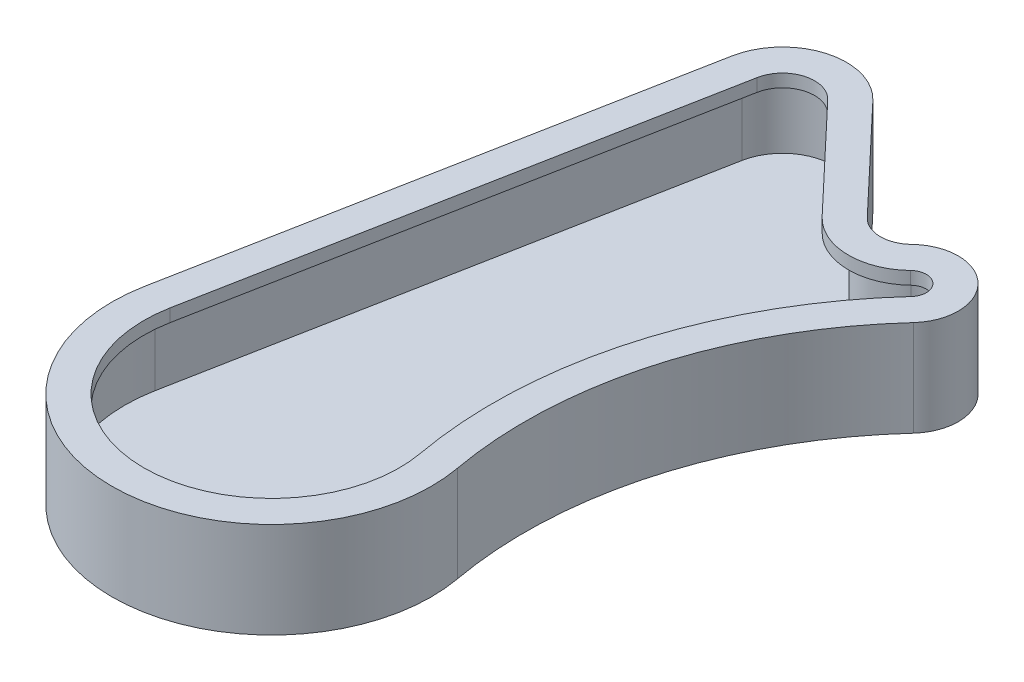
ISO-10303-21;
HEADER;
FILE_DESCRIPTION(('STEP AP214'),'2;1');
FILE_NAME('part.step','',(''),(''),'','','');
FILE_SCHEMA(('AUTOMOTIVE_DESIGN { 1 0 10303 214 1 1 1 1 }'));
ENDSEC;
DATA;
#1=APPLICATION_CONTEXT('core data for automotive mechanical design processes');
#2=APPLICATION_PROTOCOL_DEFINITION('international standard','automotive_design',2000,#1);
#3=PRODUCT_CONTEXT('',#1,'mechanical');
#4=PRODUCT('Part','Part','',(#3));
#5=PRODUCT_RELATED_PRODUCT_CATEGORY('part','',(#4));
#6=PRODUCT_DEFINITION_FORMATION('','',#4);
#7=PRODUCT_DEFINITION_CONTEXT('part definition',#1,'design');
#8=PRODUCT_DEFINITION('design','',#6,#7);
#9=PRODUCT_DEFINITION_SHAPE('','',#8);
#10=(LENGTH_UNIT() NAMED_UNIT(*) SI_UNIT(.MILLI.,.METRE.));
#11=(NAMED_UNIT(*) PLANE_ANGLE_UNIT() SI_UNIT($,.RADIAN.));
#12=(NAMED_UNIT(*) SI_UNIT($,.STERADIAN.) SOLID_ANGLE_UNIT());
#13=UNCERTAINTY_MEASURE_WITH_UNIT(LENGTH_MEASURE(1.E-05),#10,'distance_accuracy_value','');
#14=(GEOMETRIC_REPRESENTATION_CONTEXT(3) GLOBAL_UNCERTAINTY_ASSIGNED_CONTEXT((#13)) GLOBAL_UNIT_ASSIGNED_CONTEXT((#10,
#11,#12)) REPRESENTATION_CONTEXT('',''));
#15=CARTESIAN_POINT('',(0.,0.,0.));
#16=DIRECTION('',(0.,0.,1.));
#17=DIRECTION('',(1.,0.,0.));
#18=AXIS2_PLACEMENT_3D('',#15,#16,#17);
#19=CARTESIAN_POINT('',(0.,15.,0.));
#20=DIRECTION('',(0.,1.,0.));
#21=DIRECTION('',(0.,0.,1.));
#22=AXIS2_PLACEMENT_3D('',#19,#20,#21);
#23=PLANE('',#22);
#24=CARTESIAN_POINT('',(0.,15.,0.));
#25=DIRECTION('',(0.,1.,0.));
#26=DIRECTION('',(0.,0.,1.));
#27=AXIS2_PLACEMENT_3D('',#24,#25,#26);
#28=CIRCLE('',#27,25.);
#29=CARTESIAN_POINT('',(-24.5566150710964,15.,-4.6875));
#30=VERTEX_POINT('',#29);
#31=CARTESIAN_POINT('',(24.595709121542,15.,-4.47784466104999));
#32=VERTEX_POINT('',#31);
#33=EDGE_CURVE('E298',#30,#32,#28,.T.);
#34=ORIENTED_EDGE('',*,*,#33,.T.);
#35=CARTESIAN_POINT('',(88.5445528375513,15.,-16.1202407797801));
#36=DIRECTION('',(0.,-1.,0.));
#37=DIRECTION('',(0.,0.,-1.));
#38=AXIS2_PLACEMENT_3D('',#35,#36,#37);
#39=CIRCLE('',#38,65.);
#40=CARTESIAN_POINT('',(40.5390916728501,15.,-59.9434731841152));
#41=VERTEX_POINT('',#40);
#42=EDGE_CURVE('E301',#32,#41,#39,.T.);
#43=ORIENTED_EDGE('',*,*,#42,.T.);
#44=CARTESIAN_POINT('',(35.,15.,-65.));
#45=DIRECTION('',(0.,1.,0.));
#46=DIRECTION('',(0.,0.,1.));
#47=AXIS2_PLACEMENT_3D('',#44,#45,#46);
#48=CIRCLE('',#47,7.50000000000001);
#49=CARTESIAN_POINT('',(29.7951945281308,15.,-70.4));
#50=VERTEX_POINT('',#49);
#51=EDGE_CURVE('E304',#41,#50,#48,.T.);
#52=ORIENTED_EDGE('',*,*,#51,.T.);
#53=CARTESIAN_POINT('',(26.3253242135513,15.,-74.));
#54=DIRECTION('',(0.,-1.,0.));
#55=DIRECTION('',(0.,0.,1.));
#56=AXIS2_PLACEMENT_3D('',#53,#54,#55);
#57=CIRCLE('',#56,5.);
#58=CARTESIAN_POINT('',(22.6931837774403,15.,-70.5637875717051));
#59=VERTEX_POINT('',#58);
#60=EDGE_CURVE('E306',#50,#59,#57,.T.);
#61=ORIENTED_EDGE('',*,*,#60,.T.);
#62=DIRECTION('',(-0.687242485658972,0.,-0.726428087222182));
#63=VECTOR('',#62,1.);
#64=CARTESIAN_POINT('',(7.26428087222182,15.,-86.8724248565897));
#65=LINE('',#64,#63);
#66=CARTESIAN_POINT('',(7.26428087222182,15.,-86.8724248565897));
#67=VERTEX_POINT('',#66);
#68=EDGE_CURVE('E308',#59,#67,#65,.T.);
#69=ORIENTED_EDGE('',*,*,#68,.T.);
#70=CARTESIAN_POINT('',(0.,15.,-80.));
#71=DIRECTION('',(0.,1.,0.));
#72=DIRECTION('',(0.,0.,1.));
#73=AXIS2_PLACEMENT_3D('',#70,#71,#72);
#74=CIRCLE('',#73,9.99999999999999);
#75=CARTESIAN_POINT('',(-9.82264602843857,15.,-81.875));
#76=VERTEX_POINT('',#75);
#77=EDGE_CURVE('E310',#67,#76,#74,.T.);
#78=ORIENTED_EDGE('',*,*,#77,.T.);
#79=DIRECTION('',(-0.1875,0.,0.982264602843857));
#80=VECTOR('',#79,1.);
#81=CARTESIAN_POINT('',(-24.5566150710964,15.,-4.6875));
#82=LINE('',#81,#80);
#83=EDGE_CURVE('E312',#76,#30,#82,.T.);
#84=ORIENTED_EDGE('',*,*,#83,.T.);
#85=EDGE_LOOP('',(#34,#43,#52,#61,#69,#78,#84));
#86=FACE_BOUND('',#85,.T.);
#87=CARTESIAN_POINT('',(0.,15.,0.));
#88=DIRECTION('',(0.,1.,0.));
#89=DIRECTION('',(0.,0.,1.));
#90=AXIS2_PLACEMENT_3D('',#87,#88,#89);
#91=CIRCLE('',#90,20.);
#92=CARTESIAN_POINT('',(-19.6452920568771,15.,-3.75));
#93=VERTEX_POINT('',#92);
#94=CARTESIAN_POINT('',(19.6765672972336,15.,-3.58227572884001));
#95=VERTEX_POINT('',#94);
#96=EDGE_CURVE('E186',#93,#95,#91,.T.);
#97=ORIENTED_EDGE('',*,*,#96,.F.);
#98=DIRECTION('',(-0.1875,0.,0.982264602843857));
#99=VECTOR('',#98,1.);
#100=CARTESIAN_POINT('',(-4.91132301421928,15.,-80.9375));
#101=LINE('',#100,#99);
#102=CARTESIAN_POINT('',(-4.91132301421928,15.,-80.9375));
#103=VERTEX_POINT('',#102);
#104=EDGE_CURVE('E204',#103,#93,#101,.T.);
#105=ORIENTED_EDGE('',*,*,#104,.F.);
#106=CARTESIAN_POINT('',(0.,15.,-80.));
#107=DIRECTION('',(0.,1.,0.));
#108=DIRECTION('',(0.,0.,1.));
#109=AXIS2_PLACEMENT_3D('',#106,#107,#108);
#110=CIRCLE('',#109,4.99999999999999);
#111=CARTESIAN_POINT('',(3.63214043611092,15.,-83.4362124282948));
#112=VERTEX_POINT('',#111);
#113=EDGE_CURVE('E207',#112,#103,#110,.T.);
#114=ORIENTED_EDGE('',*,*,#113,.F.);
#115=DIRECTION('',(-0.687242485658972,0.,-0.726428087222182));
#116=VECTOR('',#115,1.);
#117=CARTESIAN_POINT('',(19.0610433413294,15.,-67.1275751434103));
#118=LINE('',#117,#116);
#119=CARTESIAN_POINT('',(19.0610433413294,15.,-67.1275751434103));
#120=VERTEX_POINT('',#119);
#121=EDGE_CURVE('E229',#120,#112,#118,.T.);
#122=ORIENTED_EDGE('',*,*,#121,.F.);
#123=CARTESIAN_POINT('',(26.3253242135513,15.,-74.));
#124=DIRECTION('',(0.,-1.,0.));
#125=DIRECTION('',(0.,0.,1.));
#126=AXIS2_PLACEMENT_3D('',#123,#124,#125);
#127=CIRCLE('',#126,10.);
#128=CARTESIAN_POINT('',(33.2650648427102,15.,-66.8));
#129=VERTEX_POINT('',#128);
#130=EDGE_CURVE('E226',#129,#120,#127,.T.);
#131=ORIENTED_EDGE('',*,*,#130,.F.);
#132=CARTESIAN_POINT('',(35.,15.,-65.));
#133=DIRECTION('',(0.,1.,0.));
#134=DIRECTION('',(0.,0.,1.));
#135=AXIS2_PLACEMENT_3D('',#132,#133,#134);
#136=CIRCLE('',#135,2.5);
#137=CARTESIAN_POINT('',(36.8463638909501,15.,-63.3144910613717));
#138=VERTEX_POINT('',#137);
#139=EDGE_CURVE('E223',#138,#129,#136,.T.);
#140=ORIENTED_EDGE('',*,*,#139,.F.);
#141=CARTESIAN_POINT('',(88.5445528375513,15.,-16.1202407797801));
#142=DIRECTION('',(0.,-1.,0.));
#143=DIRECTION('',(0.,0.,1.));
#144=AXIS2_PLACEMENT_3D('',#141,#142,#143);
#145=CIRCLE('',#144,70.);
#146=EDGE_CURVE('E221',#95,#138,#145,.T.);
#147=ORIENTED_EDGE('',*,*,#146,.F.);
#148=EDGE_LOOP('',(#97,#105,#114,#122,#131,#140,#147));
#149=FACE_BOUND('',#148,.T.);
#150=ADVANCED_FACE('F35',(#86,#149),#23,.T.);
#151=CARTESIAN_POINT('',(0.,15.,0.));
#152=DIRECTION('',(0.,-1.,0.));
#153=DIRECTION('',(0.,0.,-1.));
#154=AXIS2_PLACEMENT_3D('',#151,#152,#153);
#155=CYLINDRICAL_SURFACE('',#154,25.);
#156=DIRECTION('',(0.,-1.,0.));
#157=VECTOR('',#156,1.);
#158=CARTESIAN_POINT('',(-24.5566150710964,15.,-4.6875));
#159=LINE('',#158,#157);
#160=CARTESIAN_POINT('',(-24.5566150710964,0.,-4.6875));
#161=VERTEX_POINT('',#160);
#162=EDGE_CURVE('E314',#30,#161,#159,.T.);
#163=ORIENTED_EDGE('',*,*,#162,.T.);
#164=CARTESIAN_POINT('',(0.,0.,0.));
#165=DIRECTION('',(0.,1.,0.));
#166=DIRECTION('',(0.,0.,1.));
#167=AXIS2_PLACEMENT_3D('',#164,#165,#166);
#168=CIRCLE('',#167,25.);
#169=CARTESIAN_POINT('',(24.595709121542,0.,-4.47784466104999));
#170=VERTEX_POINT('',#169);
#171=EDGE_CURVE('E283',#161,#170,#168,.T.);
#172=ORIENTED_EDGE('',*,*,#171,.T.);
#173=DIRECTION('',(0.,-1.,0.));
#174=VECTOR('',#173,1.);
#175=CARTESIAN_POINT('',(24.595709121542,15.,-4.47784466104999));
#176=LINE('',#175,#174);
#177=EDGE_CURVE('E43',#32,#170,#176,.T.);
#178=ORIENTED_EDGE('',*,*,#177,.F.);
#179=ORIENTED_EDGE('',*,*,#33,.F.);
#180=EDGE_LOOP('',(#163,#172,#178,#179));
#181=FACE_BOUND('',#180,.T.);
#182=ADVANCED_FACE('F37',(#181),#155,.T.);
#183=CARTESIAN_POINT('',(88.5445528375513,15.,-16.1202407797801));
#184=DIRECTION('',(0.,-1.,0.));
#185=DIRECTION('',(0.,0.,-1.));
#186=AXIS2_PLACEMENT_3D('',#183,#184,#185);
#187=CYLINDRICAL_SURFACE('',#186,65.);
#188=ORIENTED_EDGE('',*,*,#177,.T.);
#189=CARTESIAN_POINT('',(88.5445528375513,0.,-16.1202407797801));
#190=DIRECTION('',(0.,-1.,0.));
#191=DIRECTION('',(0.,0.,-1.));
#192=AXIS2_PLACEMENT_3D('',#189,#190,#191);
#193=CIRCLE('',#192,65.);
#194=CARTESIAN_POINT('',(40.5390916728501,0.,-59.9434731841152));
#195=VERTEX_POINT('',#194);
#196=EDGE_CURVE('E317',#170,#195,#193,.T.);
#197=ORIENTED_EDGE('',*,*,#196,.T.);
#198=DIRECTION('',(0.,-1.,0.));
#199=VECTOR('',#198,1.);
#200=CARTESIAN_POINT('',(40.5390916728501,15.,-59.9434731841152));
#201=LINE('',#200,#199);
#202=EDGE_CURVE('E343',#41,#195,#201,.T.);
#203=ORIENTED_EDGE('',*,*,#202,.F.);
#204=ORIENTED_EDGE('',*,*,#42,.F.);
#205=EDGE_LOOP('',(#188,#197,#203,#204));
#206=FACE_BOUND('',#205,.T.);
#207=ADVANCED_FACE('F347',(#206),#187,.F.);
#208=CARTESIAN_POINT('',(35.,15.,-65.));
#209=DIRECTION('',(0.,-1.,0.));
#210=DIRECTION('',(0.,0.,-1.));
#211=AXIS2_PLACEMENT_3D('',#208,#209,#210);
#212=CYLINDRICAL_SURFACE('',#211,7.50000000000001);
#213=ORIENTED_EDGE('',*,*,#202,.T.);
#214=CARTESIAN_POINT('',(35.,0.,-65.));
#215=DIRECTION('',(0.,1.,0.));
#216=DIRECTION('',(0.,0.,1.));
#217=AXIS2_PLACEMENT_3D('',#214,#215,#216);
#218=CIRCLE('',#217,7.50000000000001);
#219=CARTESIAN_POINT('',(29.7951945281308,0.,-70.4));
#220=VERTEX_POINT('',#219);
#221=EDGE_CURVE('E320',#195,#220,#218,.T.);
#222=ORIENTED_EDGE('',*,*,#221,.T.);
#223=DIRECTION('',(0.,-1.,0.));
#224=VECTOR('',#223,1.);
#225=CARTESIAN_POINT('',(29.7951945281308,15.,-70.4));
#226=LINE('',#225,#224);
#227=EDGE_CURVE('E341',#50,#220,#226,.T.);
#228=ORIENTED_EDGE('',*,*,#227,.F.);
#229=ORIENTED_EDGE('',*,*,#51,.F.);
#230=EDGE_LOOP('',(#213,#222,#228,#229));
#231=FACE_BOUND('',#230,.T.);
#232=ADVANCED_FACE('F378',(#231),#212,.T.);
#233=CARTESIAN_POINT('',(26.3253242135513,15.,-74.));
#234=DIRECTION('',(0.,-1.,0.));
#235=DIRECTION('',(0.,0.,-1.));
#236=AXIS2_PLACEMENT_3D('',#233,#234,#235);
#237=CYLINDRICAL_SURFACE('',#236,5.);
#238=ORIENTED_EDGE('',*,*,#227,.T.);
#239=CARTESIAN_POINT('',(26.3253242135513,0.,-74.));
#240=DIRECTION('',(0.,-1.,0.));
#241=DIRECTION('',(0.,0.,1.));
#242=AXIS2_PLACEMENT_3D('',#239,#240,#241);
#243=CIRCLE('',#242,5.);
#244=CARTESIAN_POINT('',(22.6931837774403,0.,-70.5637875717051));
#245=VERTEX_POINT('',#244);
#246=EDGE_CURVE('E323',#220,#245,#243,.T.);
#247=ORIENTED_EDGE('',*,*,#246,.T.);
#248=DIRECTION('',(0.,-1.,0.));
#249=VECTOR('',#248,1.);
#250=CARTESIAN_POINT('',(22.6931837774403,15.,-70.5637875717051));
#251=LINE('',#250,#249);
#252=EDGE_CURVE('E339',#59,#245,#251,.T.);
#253=ORIENTED_EDGE('',*,*,#252,.F.);
#254=ORIENTED_EDGE('',*,*,#60,.F.);
#255=EDGE_LOOP('',(#238,#247,#253,#254));
#256=FACE_BOUND('',#255,.T.);
#257=ADVANCED_FACE('F374',(#256),#237,.F.);
#258=CARTESIAN_POINT('',(7.26428087222182,15.,-86.8724248565897));
#259=DIRECTION('',(-0.726428087222182,0.,0.687242485658972));
#260=DIRECTION('',(0.687242485658972,0.,0.726428087222182));
#261=AXIS2_PLACEMENT_3D('',#258,#259,#260);
#262=PLANE('',#261);
#263=ORIENTED_EDGE('',*,*,#252,.T.);
#264=DIRECTION('',(-0.687242485658972,0.,-0.726428087222182));
#265=VECTOR('',#264,1.);
#266=CARTESIAN_POINT('',(7.26428087222182,0.,-86.8724248565897));
#267=LINE('',#266,#265);
#268=CARTESIAN_POINT('',(7.26428087222182,0.,-86.8724248565897));
#269=VERTEX_POINT('',#268);
#270=EDGE_CURVE('E326',#245,#269,#267,.T.);
#271=ORIENTED_EDGE('',*,*,#270,.T.);
#272=DIRECTION('',(0.,-1.,0.));
#273=VECTOR('',#272,1.);
#274=CARTESIAN_POINT('',(7.26428087222182,15.,-86.8724248565897));
#275=LINE('',#274,#273);
#276=EDGE_CURVE('E337',#67,#269,#275,.T.);
#277=ORIENTED_EDGE('',*,*,#276,.F.);
#278=ORIENTED_EDGE('',*,*,#68,.F.);
#279=EDGE_LOOP('',(#263,#271,#277,#278));
#280=FACE_BOUND('',#279,.T.);
#281=ADVANCED_FACE('F370',(#280),#262,.F.);
#282=CARTESIAN_POINT('',(0.,15.,-80.));
#283=DIRECTION('',(0.,-1.,0.));
#284=DIRECTION('',(0.,0.,-1.));
#285=AXIS2_PLACEMENT_3D('',#282,#283,#284);
#286=CYLINDRICAL_SURFACE('',#285,9.99999999999999);
#287=ORIENTED_EDGE('',*,*,#276,.T.);
#288=CARTESIAN_POINT('',(0.,0.,-80.));
#289=DIRECTION('',(0.,1.,0.));
#290=DIRECTION('',(0.,0.,1.));
#291=AXIS2_PLACEMENT_3D('',#288,#289,#290);
#292=CIRCLE('',#291,9.99999999999999);
#293=CARTESIAN_POINT('',(-9.82264602843857,0.,-81.875));
#294=VERTEX_POINT('',#293);
#295=EDGE_CURVE('E329',#269,#294,#292,.T.);
#296=ORIENTED_EDGE('',*,*,#295,.T.);
#297=DIRECTION('',(0.,-1.,0.));
#298=VECTOR('',#297,1.);
#299=CARTESIAN_POINT('',(-9.82264602843857,15.,-81.875));
#300=LINE('',#299,#298);
#301=EDGE_CURVE('E335',#76,#294,#300,.T.);
#302=ORIENTED_EDGE('',*,*,#301,.F.);
#303=ORIENTED_EDGE('',*,*,#77,.F.);
#304=EDGE_LOOP('',(#287,#296,#302,#303));
#305=FACE_BOUND('',#304,.T.);
#306=ADVANCED_FACE('F365',(#305),#286,.T.);
#307=CARTESIAN_POINT('',(-24.5566150710964,15.,-4.6875));
#308=DIRECTION('',(0.982264602843857,0.,0.1875));
#309=DIRECTION('',(0.1875,0.,-0.982264602843857));
#310=AXIS2_PLACEMENT_3D('',#307,#308,#309);
#311=PLANE('',#310);
#312=ORIENTED_EDGE('',*,*,#301,.T.);
#313=DIRECTION('',(-0.1875,0.,0.982264602843857));
#314=VECTOR('',#313,1.);
#315=CARTESIAN_POINT('',(-24.5566150710964,0.,-4.6875));
#316=LINE('',#315,#314);
#317=EDGE_CURVE('E302',#294,#161,#316,.T.);
#318=ORIENTED_EDGE('',*,*,#317,.T.);
#319=ORIENTED_EDGE('',*,*,#162,.F.);
#320=ORIENTED_EDGE('',*,*,#83,.F.);
#321=EDGE_LOOP('',(#312,#318,#319,#320));
#322=FACE_BOUND('',#321,.T.);
#323=ADVANCED_FACE('F360',(#322),#311,.F.);
#324=CARTESIAN_POINT('',(0.,0.,0.));
#325=DIRECTION('',(0.,1.,0.));
#326=DIRECTION('',(0.,0.,1.));
#327=AXIS2_PLACEMENT_3D('',#324,#325,#326);
#328=PLANE('',#327);
#329=ORIENTED_EDGE('',*,*,#171,.F.);
#330=ORIENTED_EDGE('',*,*,#317,.F.);
#331=ORIENTED_EDGE('',*,*,#295,.F.);
#332=ORIENTED_EDGE('',*,*,#270,.F.);
#333=ORIENTED_EDGE('',*,*,#246,.F.);
#334=ORIENTED_EDGE('',*,*,#221,.F.);
#335=ORIENTED_EDGE('',*,*,#196,.F.);
#336=EDGE_LOOP('',(#329,#330,#331,#332,#333,#334,#335));
#337=FACE_BOUND('',#336,.T.);
#338=ADVANCED_FACE('F354',(#337),#328,.F.);
#339=CARTESIAN_POINT('',(0.,13.,0.));
#340=DIRECTION('',(0.,1.,0.));
#341=DIRECTION('',(0.,0.,1.));
#342=AXIS2_PLACEMENT_3D('',#339,#340,#341);
#343=PLANE('',#342);
#344=CARTESIAN_POINT('',(88.5445528375513,13.,-16.1202407797801));
#345=DIRECTION('',(0.,1.,0.));
#346=DIRECTION('',(0.,0.,1.));
#347=AXIS2_PLACEMENT_3D('',#344,#345,#346);
#348=CIRCLE('',#347,67.);
#349=CARTESIAN_POINT('',(39.0620005600901,13.,-61.2918803350178));
#350=VERTEX_POINT('',#349);
#351=CARTESIAN_POINT('',(22.6280523918187,13.,-4.11961708816601));
#352=VERTEX_POINT('',#351);
#353=EDGE_CURVE('E11',#350,#352,#348,.T.);
#354=ORIENTED_EDGE('',*,*,#353,.T.);
#355=CARTESIAN_POINT('',(0.,13.,0.));
#356=DIRECTION('',(0.,1.,0.));
#357=DIRECTION('',(0.,0.,1.));
#358=AXIS2_PLACEMENT_3D('',#355,#356,#357);
#359=CIRCLE('',#358,23.);
#360=CARTESIAN_POINT('',(-22.5920858654087,13.,-4.3125));
#361=VERTEX_POINT('',#360);
#362=EDGE_CURVE('E256',#352,#361,#359,.F.);
#363=ORIENTED_EDGE('',*,*,#362,.T.);
#364=DIRECTION('',(0.1875,0.,-0.982264602843857));
#365=VECTOR('',#364,1.);
#366=CARTESIAN_POINT('',(-7.85811682275085,13.,-81.5));
#367=LINE('',#366,#365);
#368=CARTESIAN_POINT('',(-7.85811682275085,13.,-81.5));
#369=VERTEX_POINT('',#368);
#370=EDGE_CURVE('E50',#361,#369,#367,.T.);
#371=ORIENTED_EDGE('',*,*,#370,.T.);
#372=CARTESIAN_POINT('',(0.,13.,-80.));
#373=DIRECTION('',(0.,1.,0.));
#374=DIRECTION('',(0.,0.,1.));
#375=AXIS2_PLACEMENT_3D('',#372,#373,#374);
#376=CIRCLE('',#375,8.);
#377=CARTESIAN_POINT('',(5.81142469777746,13.,-85.4979398852718));
#378=VERTEX_POINT('',#377);
#379=EDGE_CURVE('E58',#369,#378,#376,.F.);
#380=ORIENTED_EDGE('',*,*,#379,.T.);
#381=DIRECTION('',(0.687242485658972,0.,0.726428087222182));
#382=VECTOR('',#381,1.);
#383=CARTESIAN_POINT('',(21.240327602996,13.,-69.1893026003872));
#384=LINE('',#383,#382);
#385=CARTESIAN_POINT('',(21.240327602996,13.,-69.1893026003872));
#386=VERTEX_POINT('',#385);
#387=EDGE_CURVE('E251',#378,#386,#384,.T.);
#388=ORIENTED_EDGE('',*,*,#387,.T.);
#389=CARTESIAN_POINT('',(26.3253242135513,13.,-74.));
#390=DIRECTION('',(0.,1.,0.));
#391=DIRECTION('',(0.,0.,1.));
#392=AXIS2_PLACEMENT_3D('',#389,#390,#391);
#393=CIRCLE('',#392,7.);
#394=CARTESIAN_POINT('',(31.1831426539625,13.,-68.96));
#395=VERTEX_POINT('',#394);
#396=EDGE_CURVE('E248',#386,#395,#393,.T.);
#397=ORIENTED_EDGE('',*,*,#396,.T.);
#398=CARTESIAN_POINT('',(35.,13.,-65.));
#399=DIRECTION('',(0.,1.,0.));
#400=DIRECTION('',(0.,0.,1.));
#401=AXIS2_PLACEMENT_3D('',#398,#399,#400);
#402=CIRCLE('',#401,5.50000000000001);
#403=EDGE_CURVE('E236',#395,#350,#402,.F.);
#404=ORIENTED_EDGE('',*,*,#403,.T.);
#405=EDGE_LOOP('',(#354,#363,#371,#380,#388,#397,#404));
#406=FACE_BOUND('',#405,.T.);
#407=DIRECTION('',(-0.1875,0.,0.982264602843857));
#408=VECTOR('',#407,1.);
#409=CARTESIAN_POINT('',(-4.91132301421928,13.,-80.9375));
#410=LINE('',#409,#408);
#411=CARTESIAN_POINT('',(-4.91132301421928,13.,-80.9375));
#412=VERTEX_POINT('',#411);
#413=CARTESIAN_POINT('',(-19.6452920568771,13.,-3.75));
#414=VERTEX_POINT('',#413);
#415=EDGE_CURVE('E191',#412,#414,#410,.T.);
#416=ORIENTED_EDGE('',*,*,#415,.T.);
#417=CARTESIAN_POINT('',(0.,13.,0.));
#418=DIRECTION('',(0.,1.,0.));
#419=DIRECTION('',(0.,0.,1.));
#420=AXIS2_PLACEMENT_3D('',#417,#418,#419);
#421=CIRCLE('',#420,20.);
#422=CARTESIAN_POINT('',(19.6765672972336,13.,-3.58227572884001));
#423=VERTEX_POINT('',#422);
#424=EDGE_CURVE('E183',#414,#423,#421,.T.);
#425=ORIENTED_EDGE('',*,*,#424,.T.);
#426=CARTESIAN_POINT('',(88.5445528375513,13.,-16.1202407797801));
#427=DIRECTION('',(0.,-1.,0.));
#428=DIRECTION('',(0.,0.,1.));
#429=AXIS2_PLACEMENT_3D('',#426,#427,#428);
#430=CIRCLE('',#429,70.);
#431=CARTESIAN_POINT('',(36.8463638909501,13.,-63.3144910613717));
#432=VERTEX_POINT('',#431);
#433=EDGE_CURVE('E195',#423,#432,#430,.T.);
#434=ORIENTED_EDGE('',*,*,#433,.T.);
#435=CARTESIAN_POINT('',(35.,13.,-65.));
#436=DIRECTION('',(0.,1.,0.));
#437=DIRECTION('',(0.,0.,1.));
#438=AXIS2_PLACEMENT_3D('',#435,#436,#437);
#439=CIRCLE('',#438,2.5);
#440=CARTESIAN_POINT('',(33.2650648427102,13.,-66.8));
#441=VERTEX_POINT('',#440);
#442=EDGE_CURVE('E199',#432,#441,#439,.T.);
#443=ORIENTED_EDGE('',*,*,#442,.T.);
#444=CARTESIAN_POINT('',(26.3253242135513,13.,-74.));
#445=DIRECTION('',(0.,-1.,0.));
#446=DIRECTION('',(0.,0.,1.));
#447=AXIS2_PLACEMENT_3D('',#444,#445,#446);
#448=CIRCLE('',#447,10.);
#449=CARTESIAN_POINT('',(19.0610433413294,13.,-67.1275751434103));
#450=VERTEX_POINT('',#449);
#451=EDGE_CURVE('E211',#441,#450,#448,.T.);
#452=ORIENTED_EDGE('',*,*,#451,.T.);
#453=DIRECTION('',(-0.687242485658972,0.,-0.726428087222182));
#454=VECTOR('',#453,1.);
#455=CARTESIAN_POINT('',(19.0610433413294,13.,-67.1275751434103));
#456=LINE('',#455,#454);
#457=CARTESIAN_POINT('',(3.63214043611092,13.,-83.4362124282948));
#458=VERTEX_POINT('',#457);
#459=EDGE_CURVE('E214',#450,#458,#456,.T.);
#460=ORIENTED_EDGE('',*,*,#459,.T.);
#461=CARTESIAN_POINT('',(0.,13.,-80.));
#462=DIRECTION('',(0.,1.,0.));
#463=DIRECTION('',(0.,0.,1.));
#464=AXIS2_PLACEMENT_3D('',#461,#462,#463);
#465=CIRCLE('',#464,4.99999999999999);
#466=EDGE_CURVE('E217',#458,#412,#465,.T.);
#467=ORIENTED_EDGE('',*,*,#466,.T.);
#468=EDGE_LOOP('',(#416,#425,#434,#443,#452,#460,#467));
#469=FACE_BOUND('',#468,.T.);
#470=ADVANCED_FACE('F201',(#406,#469),#343,.F.);
#471=CARTESIAN_POINT('',(0.,13.,0.));
#472=DIRECTION('',(0.,1.,0.));
#473=DIRECTION('',(0.,0.,1.));
#474=AXIS2_PLACEMENT_3D('',#471,#472,#473);
#475=CYLINDRICAL_SURFACE('',#474,20.);
#476=ORIENTED_EDGE('',*,*,#96,.T.);
#477=DIRECTION('',(0.,1.,0.));
#478=VECTOR('',#477,1.);
#479=CARTESIAN_POINT('',(19.6765672972336,13.,-3.58227572884001));
#480=LINE('',#479,#478);
#481=EDGE_CURVE('E179',#423,#95,#480,.T.);
#482=ORIENTED_EDGE('',*,*,#481,.F.);
#483=ORIENTED_EDGE('',*,*,#424,.F.);
#484=DIRECTION('',(0.,1.,0.));
#485=VECTOR('',#484,1.);
#486=CARTESIAN_POINT('',(-19.6452920568771,13.,-3.75));
#487=LINE('',#486,#485);
#488=EDGE_CURVE('E234',#414,#93,#487,.T.);
#489=ORIENTED_EDGE('',*,*,#488,.T.);
#490=EDGE_LOOP('',(#476,#482,#483,#489));
#491=FACE_BOUND('',#490,.T.);
#492=ADVANCED_FACE('F181',(#491),#475,.F.);
#493=CARTESIAN_POINT('',(-4.91132301421928,13.,-80.9375));
#494=DIRECTION('',(-0.982264602843857,0.,-0.1875));
#495=DIRECTION('',(-0.1875,0.,0.982264602843857));
#496=AXIS2_PLACEMENT_3D('',#493,#494,#495);
#497=PLANE('',#496);
#498=ORIENTED_EDGE('',*,*,#104,.T.);
#499=ORIENTED_EDGE('',*,*,#488,.F.);
#500=ORIENTED_EDGE('',*,*,#415,.F.);
#501=DIRECTION('',(0.,1.,0.));
#502=VECTOR('',#501,1.);
#503=CARTESIAN_POINT('',(-4.91132301421928,13.,-80.9375));
#504=LINE('',#503,#502);
#505=EDGE_CURVE('E237',#412,#103,#504,.T.);
#506=ORIENTED_EDGE('',*,*,#505,.T.);
#507=EDGE_LOOP('',(#498,#499,#500,#506));
#508=FACE_BOUND('',#507,.T.);
#509=ADVANCED_FACE('F400',(#508),#497,.F.);
#510=CARTESIAN_POINT('',(0.,13.,-80.));
#511=DIRECTION('',(0.,1.,0.));
#512=DIRECTION('',(0.,0.,1.));
#513=AXIS2_PLACEMENT_3D('',#510,#511,#512);
#514=CYLINDRICAL_SURFACE('',#513,4.99999999999999);
#515=ORIENTED_EDGE('',*,*,#113,.T.);
#516=ORIENTED_EDGE('',*,*,#505,.F.);
#517=ORIENTED_EDGE('',*,*,#466,.F.);
#518=DIRECTION('',(0.,1.,0.));
#519=VECTOR('',#518,1.);
#520=CARTESIAN_POINT('',(3.63214043611092,13.,-83.4362124282948));
#521=LINE('',#520,#519);
#522=EDGE_CURVE('E239',#458,#112,#521,.T.);
#523=ORIENTED_EDGE('',*,*,#522,.T.);
#524=EDGE_LOOP('',(#515,#516,#517,#523));
#525=FACE_BOUND('',#524,.T.);
#526=ADVANCED_FACE('F398',(#525),#514,.F.);
#527=CARTESIAN_POINT('',(19.0610433413294,13.,-67.1275751434103));
#528=DIRECTION('',(0.726428087222182,0.,-0.687242485658972));
#529=DIRECTION('',(-0.687242485658972,0.,-0.726428087222182));
#530=AXIS2_PLACEMENT_3D('',#527,#528,#529);
#531=PLANE('',#530);
#532=ORIENTED_EDGE('',*,*,#121,.T.);
#533=ORIENTED_EDGE('',*,*,#522,.F.);
#534=ORIENTED_EDGE('',*,*,#459,.F.);
#535=DIRECTION('',(0.,1.,0.));
#536=VECTOR('',#535,1.);
#537=CARTESIAN_POINT('',(19.0610433413294,13.,-67.1275751434103));
#538=LINE('',#537,#536);
#539=EDGE_CURVE('E241',#450,#120,#538,.T.);
#540=ORIENTED_EDGE('',*,*,#539,.T.);
#541=EDGE_LOOP('',(#532,#533,#534,#540));
#542=FACE_BOUND('',#541,.T.);
#543=ADVANCED_FACE('F395',(#542),#531,.F.);
#544=CARTESIAN_POINT('',(26.3253242135513,13.,-74.));
#545=DIRECTION('',(0.,1.,0.));
#546=DIRECTION('',(0.,0.,1.));
#547=AXIS2_PLACEMENT_3D('',#544,#545,#546);
#548=CYLINDRICAL_SURFACE('',#547,10.);
#549=ORIENTED_EDGE('',*,*,#130,.T.);
#550=ORIENTED_EDGE('',*,*,#539,.F.);
#551=ORIENTED_EDGE('',*,*,#451,.F.);
#552=DIRECTION('',(0.,1.,0.));
#553=VECTOR('',#552,1.);
#554=CARTESIAN_POINT('',(33.2650648427102,13.,-66.8));
#555=LINE('',#554,#553);
#556=EDGE_CURVE('E243',#441,#129,#555,.T.);
#557=ORIENTED_EDGE('',*,*,#556,.T.);
#558=EDGE_LOOP('',(#549,#550,#551,#557));
#559=FACE_BOUND('',#558,.T.);
#560=ADVANCED_FACE('F393',(#559),#548,.T.);
#561=CARTESIAN_POINT('',(35.,13.,-65.));
#562=DIRECTION('',(0.,1.,0.));
#563=DIRECTION('',(0.,0.,1.));
#564=AXIS2_PLACEMENT_3D('',#561,#562,#563);
#565=CYLINDRICAL_SURFACE('',#564,2.5);
#566=ORIENTED_EDGE('',*,*,#139,.T.);
#567=ORIENTED_EDGE('',*,*,#556,.F.);
#568=ORIENTED_EDGE('',*,*,#442,.F.);
#569=DIRECTION('',(0.,1.,0.));
#570=VECTOR('',#569,1.);
#571=CARTESIAN_POINT('',(36.8463638909501,13.,-63.3144910613717));
#572=LINE('',#571,#570);
#573=EDGE_CURVE('E190',#432,#138,#572,.T.);
#574=ORIENTED_EDGE('',*,*,#573,.T.);
#575=EDGE_LOOP('',(#566,#567,#568,#574));
#576=FACE_BOUND('',#575,.T.);
#577=ADVANCED_FACE('F389',(#576),#565,.F.);
#578=CARTESIAN_POINT('',(88.5445528375513,13.,-16.1202407797801));
#579=DIRECTION('',(0.,1.,0.));
#580=DIRECTION('',(0.,0.,1.));
#581=AXIS2_PLACEMENT_3D('',#578,#579,#580);
#582=CYLINDRICAL_SURFACE('',#581,70.);
#583=ORIENTED_EDGE('',*,*,#146,.T.);
#584=ORIENTED_EDGE('',*,*,#573,.F.);
#585=ORIENTED_EDGE('',*,*,#433,.F.);
#586=ORIENTED_EDGE('',*,*,#481,.T.);
#587=EDGE_LOOP('',(#583,#584,#585,#586));
#588=FACE_BOUND('',#587,.T.);
#589=ADVANCED_FACE('F196',(#588),#582,.T.);
#590=CARTESIAN_POINT('',(0.,2.,0.));
#591=DIRECTION('',(0.,1.,0.));
#592=DIRECTION('',(0.,0.,1.));
#593=AXIS2_PLACEMENT_3D('',#590,#591,#592);
#594=PLANE('',#593);
#595=CARTESIAN_POINT('',(0.,2.,0.));
#596=DIRECTION('',(0.,1.,0.));
#597=DIRECTION('',(0.,0.,1.));
#598=AXIS2_PLACEMENT_3D('',#595,#596,#597);
#599=CIRCLE('',#598,23.);
#600=CARTESIAN_POINT('',(-22.5920858654087,2.,-4.3125));
#601=VERTEX_POINT('',#600);
#602=CARTESIAN_POINT('',(22.6280523918187,2.,-4.11961708816601));
#603=VERTEX_POINT('',#602);
#604=EDGE_CURVE('E259',#601,#603,#599,.T.);
#605=ORIENTED_EDGE('',*,*,#604,.T.);
#606=CARTESIAN_POINT('',(88.5445528375513,2.,-16.1202407797801));
#607=DIRECTION('',(0.,-1.,0.));
#608=DIRECTION('',(0.,0.,1.));
#609=AXIS2_PLACEMENT_3D('',#606,#607,#608);
#610=CIRCLE('',#609,67.);
#611=CARTESIAN_POINT('',(39.0620005600901,2.,-61.2918803350178));
#612=VERTEX_POINT('',#611);
#613=EDGE_CURVE('E262',#603,#612,#610,.T.);
#614=ORIENTED_EDGE('',*,*,#613,.T.);
#615=CARTESIAN_POINT('',(35.,2.,-65.));
#616=DIRECTION('',(0.,1.,0.));
#617=DIRECTION('',(0.,0.,1.));
#618=AXIS2_PLACEMENT_3D('',#615,#616,#617);
#619=CIRCLE('',#618,5.50000000000001);
#620=CARTESIAN_POINT('',(31.1831426539625,2.,-68.96));
#621=VERTEX_POINT('',#620);
#622=EDGE_CURVE('E265',#612,#621,#619,.T.);
#623=ORIENTED_EDGE('',*,*,#622,.T.);
#624=CARTESIAN_POINT('',(26.3253242135513,2.,-74.));
#625=DIRECTION('',(0.,-1.,0.));
#626=DIRECTION('',(0.,0.,1.));
#627=AXIS2_PLACEMENT_3D('',#624,#625,#626);
#628=CIRCLE('',#627,7.);
#629=CARTESIAN_POINT('',(21.240327602996,2.,-69.1893026003872));
#630=VERTEX_POINT('',#629);
#631=EDGE_CURVE('E268',#621,#630,#628,.T.);
#632=ORIENTED_EDGE('',*,*,#631,.T.);
#633=DIRECTION('',(-0.687242485658972,0.,-0.726428087222182));
#634=VECTOR('',#633,1.);
#635=CARTESIAN_POINT('',(21.240327602996,2.,-69.1893026003872));
#636=LINE('',#635,#634);
#637=CARTESIAN_POINT('',(5.81142469777746,2.,-85.4979398852718));
#638=VERTEX_POINT('',#637);
#639=EDGE_CURVE('E271',#630,#638,#636,.T.);
#640=ORIENTED_EDGE('',*,*,#639,.T.);
#641=CARTESIAN_POINT('',(0.,2.,-80.));
#642=DIRECTION('',(0.,1.,0.));
#643=DIRECTION('',(0.,0.,1.));
#644=AXIS2_PLACEMENT_3D('',#641,#642,#643);
#645=CIRCLE('',#644,8.);
#646=CARTESIAN_POINT('',(-7.85811682275085,2.,-81.5));
#647=VERTEX_POINT('',#646);
#648=EDGE_CURVE('E274',#638,#647,#645,.T.);
#649=ORIENTED_EDGE('',*,*,#648,.T.);
#650=DIRECTION('',(-0.1875,0.,0.982264602843857));
#651=VECTOR('',#650,1.);
#652=CARTESIAN_POINT('',(-7.85811682275085,2.,-81.5));
#653=LINE('',#652,#651);
#654=EDGE_CURVE('E277',#647,#601,#653,.T.);
#655=ORIENTED_EDGE('',*,*,#654,.T.);
#656=EDGE_LOOP('',(#605,#614,#623,#632,#640,#649,#655));
#657=FACE_BOUND('',#656,.T.);
#658=ADVANCED_FACE('F417',(#657),#594,.T.);
#659=CARTESIAN_POINT('',(88.5445528375513,2.,-16.1202407797801));
#660=DIRECTION('',(0.,1.,0.));
#661=DIRECTION('',(0.,0.,1.));
#662=AXIS2_PLACEMENT_3D('',#659,#660,#661);
#663=CYLINDRICAL_SURFACE('',#662,67.);
#664=ORIENTED_EDGE('',*,*,#353,.F.);
#665=DIRECTION('',(0.,1.,0.));
#666=VECTOR('',#665,1.);
#667=CARTESIAN_POINT('',(39.0620005600901,2.,-61.2918803350178));
#668=LINE('',#667,#666);
#669=EDGE_CURVE('E294',#612,#350,#668,.T.);
#670=ORIENTED_EDGE('',*,*,#669,.F.);
#671=ORIENTED_EDGE('',*,*,#613,.F.);
#672=DIRECTION('',(0.,1.,0.));
#673=VECTOR('',#672,1.);
#674=CARTESIAN_POINT('',(22.6280523918187,2.,-4.11961708816601));
#675=LINE('',#674,#673);
#676=EDGE_CURVE('E280',#603,#352,#675,.T.);
#677=ORIENTED_EDGE('',*,*,#676,.T.);
#678=EDGE_LOOP('',(#664,#670,#671,#677));
#679=FACE_BOUND('',#678,.T.);
#680=ADVANCED_FACE('F424',(#679),#663,.T.);
#681=CARTESIAN_POINT('',(35.,2.,-65.));
#682=DIRECTION('',(0.,1.,0.));
#683=DIRECTION('',(0.,0.,1.));
#684=AXIS2_PLACEMENT_3D('',#681,#682,#683);
#685=CYLINDRICAL_SURFACE('',#684,5.50000000000001);
#686=ORIENTED_EDGE('',*,*,#403,.F.);
#687=DIRECTION('',(0.,1.,0.));
#688=VECTOR('',#687,1.);
#689=CARTESIAN_POINT('',(31.1831426539625,2.,-68.96));
#690=LINE('',#689,#688);
#691=EDGE_CURVE('E291',#621,#395,#690,.T.);
#692=ORIENTED_EDGE('',*,*,#691,.F.);
#693=ORIENTED_EDGE('',*,*,#622,.F.);
#694=ORIENTED_EDGE('',*,*,#669,.T.);
#695=EDGE_LOOP('',(#686,#692,#693,#694));
#696=FACE_BOUND('',#695,.T.);
#697=ADVANCED_FACE('F440',(#696),#685,.F.);
#698=CARTESIAN_POINT('',(26.3253242135513,2.,-74.));
#699=DIRECTION('',(0.,1.,0.));
#700=DIRECTION('',(0.,0.,1.));
#701=AXIS2_PLACEMENT_3D('',#698,#699,#700);
#702=CYLINDRICAL_SURFACE('',#701,7.);
#703=ORIENTED_EDGE('',*,*,#396,.F.);
#704=DIRECTION('',(0.,1.,0.));
#705=VECTOR('',#704,1.);
#706=CARTESIAN_POINT('',(21.240327602996,2.,-69.1893026003872));
#707=LINE('',#706,#705);
#708=EDGE_CURVE('E288',#630,#386,#707,.T.);
#709=ORIENTED_EDGE('',*,*,#708,.F.);
#710=ORIENTED_EDGE('',*,*,#631,.F.);
#711=ORIENTED_EDGE('',*,*,#691,.T.);
#712=EDGE_LOOP('',(#703,#709,#710,#711));
#713=FACE_BOUND('',#712,.T.);
#714=ADVANCED_FACE('F436',(#713),#702,.T.);
#715=CARTESIAN_POINT('',(21.240327602996,2.,-69.1893026003872));
#716=DIRECTION('',(0.726428087222182,0.,-0.687242485658972));
#717=DIRECTION('',(-0.687242485658972,0.,-0.726428087222182));
#718=AXIS2_PLACEMENT_3D('',#715,#716,#717);
#719=PLANE('',#718);
#720=ORIENTED_EDGE('',*,*,#387,.F.);
#721=DIRECTION('',(0.,1.,0.));
#722=VECTOR('',#721,1.);
#723=CARTESIAN_POINT('',(5.81142469777746,2.,-85.4979398852718));
#724=LINE('',#723,#722);
#725=EDGE_CURVE('E286',#638,#378,#724,.T.);
#726=ORIENTED_EDGE('',*,*,#725,.F.);
#727=ORIENTED_EDGE('',*,*,#639,.F.);
#728=ORIENTED_EDGE('',*,*,#708,.T.);
#729=EDGE_LOOP('',(#720,#726,#727,#728));
#730=FACE_BOUND('',#729,.T.);
#731=ADVANCED_FACE('F433',(#730),#719,.F.);
#732=CARTESIAN_POINT('',(0.,2.,-80.));
#733=DIRECTION('',(0.,1.,0.));
#734=DIRECTION('',(0.,0.,1.));
#735=AXIS2_PLACEMENT_3D('',#732,#733,#734);
#736=CYLINDRICAL_SURFACE('',#735,8.);
#737=ORIENTED_EDGE('',*,*,#379,.F.);
#738=DIRECTION('',(0.,1.,0.));
#739=VECTOR('',#738,1.);
#740=CARTESIAN_POINT('',(-7.85811682275085,2.,-81.5));
#741=LINE('',#740,#739);
#742=EDGE_CURVE('E284',#647,#369,#741,.T.);
#743=ORIENTED_EDGE('',*,*,#742,.F.);
#744=ORIENTED_EDGE('',*,*,#648,.F.);
#745=ORIENTED_EDGE('',*,*,#725,.T.);
#746=EDGE_LOOP('',(#737,#743,#744,#745));
#747=FACE_BOUND('',#746,.T.);
#748=ADVANCED_FACE('F430',(#747),#736,.F.);
#749=CARTESIAN_POINT('',(-7.85811682275085,2.,-81.5));
#750=DIRECTION('',(-0.982264602843857,0.,-0.1875));
#751=DIRECTION('',(-0.1875,0.,0.982264602843857));
#752=AXIS2_PLACEMENT_3D('',#749,#750,#751);
#753=PLANE('',#752);
#754=ORIENTED_EDGE('',*,*,#370,.F.);
#755=DIRECTION('',(0.,1.,0.));
#756=VECTOR('',#755,1.);
#757=CARTESIAN_POINT('',(-22.5920858654087,2.,-4.3125));
#758=LINE('',#757,#756);
#759=EDGE_CURVE('E281',#601,#361,#758,.T.);
#760=ORIENTED_EDGE('',*,*,#759,.F.);
#761=ORIENTED_EDGE('',*,*,#654,.F.);
#762=ORIENTED_EDGE('',*,*,#742,.T.);
#763=EDGE_LOOP('',(#754,#760,#761,#762));
#764=FACE_BOUND('',#763,.T.);
#765=ADVANCED_FACE('F426',(#764),#753,.F.);
#766=CARTESIAN_POINT('',(0.,2.,0.));
#767=DIRECTION('',(0.,1.,0.));
#768=DIRECTION('',(0.,0.,1.));
#769=AXIS2_PLACEMENT_3D('',#766,#767,#768);
#770=CYLINDRICAL_SURFACE('',#769,23.);
#771=ORIENTED_EDGE('',*,*,#362,.F.);
#772=ORIENTED_EDGE('',*,*,#676,.F.);
#773=ORIENTED_EDGE('',*,*,#604,.F.);
#774=ORIENTED_EDGE('',*,*,#759,.T.);
#775=EDGE_LOOP('',(#771,#772,#773,#774));
#776=FACE_BOUND('',#775,.T.);
#777=ADVANCED_FACE('F429',(#776),#770,.F.);
#778=CLOSED_SHELL('',(#150,#182,#207,#232,#257,#281,#306,#323,#338,#470,#492,#509,#526,#543,
#560,#577,#589,#658,#680,#697,#714,#731,#748,#765,#777));
#779=MANIFOLD_SOLID_BREP('B2',#778);
#780=ADVANCED_BREP_SHAPE_REPRESENTATION('',(#18,#779),#14);
#781=SHAPE_DEFINITION_REPRESENTATION(#9,#780);
ENDSEC;
END-ISO-10303-21;
